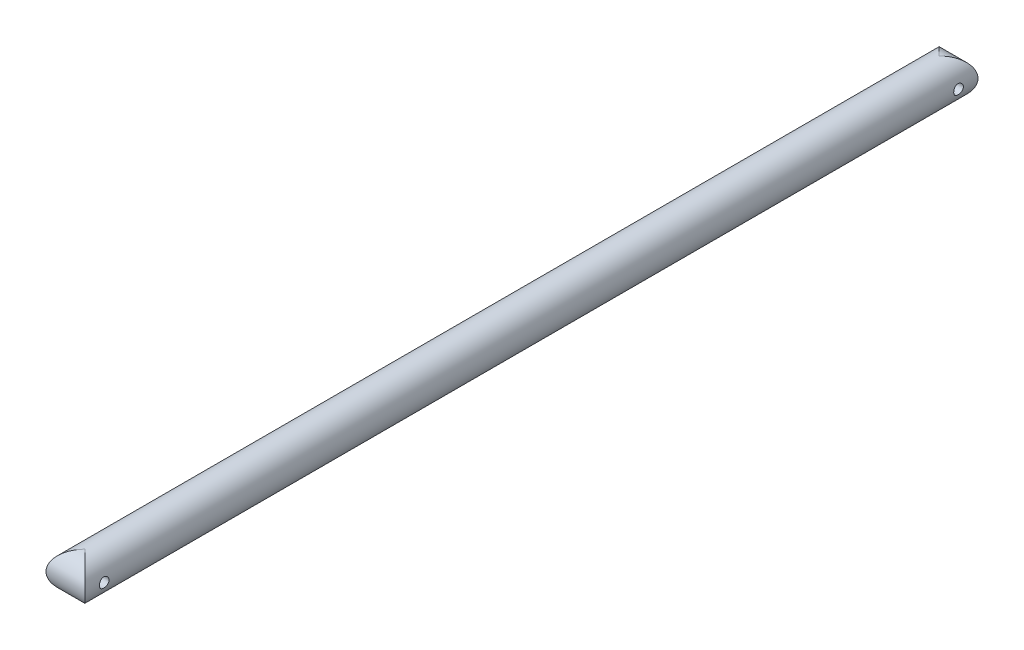
ISO-10303-21;
HEADER;
FILE_DESCRIPTION(('STEP AP214'),'2;1');
FILE_NAME('part.step','',(''),(''),'','','');
FILE_SCHEMA(('AUTOMOTIVE_DESIGN { 1 0 10303 214 1 1 1 1 }'));
ENDSEC;
DATA;
#1=APPLICATION_CONTEXT('core data for automotive mechanical design processes');
#2=APPLICATION_PROTOCOL_DEFINITION('international standard','automotive_design',2000,#1);
#3=PRODUCT_CONTEXT('',#1,'mechanical');
#4=PRODUCT('Part','Part','',(#3));
#5=PRODUCT_RELATED_PRODUCT_CATEGORY('part','',(#4));
#6=PRODUCT_DEFINITION_FORMATION('','',#4);
#7=PRODUCT_DEFINITION_CONTEXT('part definition',#1,'design');
#8=PRODUCT_DEFINITION('design','',#6,#7);
#9=PRODUCT_DEFINITION_SHAPE('','',#8);
#10=(LENGTH_UNIT() NAMED_UNIT(*) SI_UNIT(.MILLI.,.METRE.));
#11=(NAMED_UNIT(*) PLANE_ANGLE_UNIT() SI_UNIT($,.RADIAN.));
#12=(NAMED_UNIT(*) SI_UNIT($,.STERADIAN.) SOLID_ANGLE_UNIT());
#13=UNCERTAINTY_MEASURE_WITH_UNIT(LENGTH_MEASURE(1.E-05),#10,'distance_accuracy_value','');
#14=(GEOMETRIC_REPRESENTATION_CONTEXT(3) GLOBAL_UNCERTAINTY_ASSIGNED_CONTEXT((#13)) GLOBAL_UNIT_ASSIGNED_CONTEXT((#10,
#11,#12)) REPRESENTATION_CONTEXT('',''));
#15=CARTESIAN_POINT('',(0.,0.,0.));
#16=DIRECTION('',(0.,0.,1.));
#17=DIRECTION('',(1.,0.,0.));
#18=AXIS2_PLACEMENT_3D('',#15,#16,#17);
#19=CARTESIAN_POINT('',(0.,0.,292.1));
#20=DIRECTION('',(0.,0.,-1.));
#21=DIRECTION('',(-1.,0.,0.));
#22=AXIS2_PLACEMENT_3D('',#19,#20,#21);
#23=CYLINDRICAL_SURFACE('',#22,12.7);
#24=CARTESIAN_POINT('',(-12.7,0.,276.225));
#25=CARTESIAN_POINT('',(-12.6999970338729,0.175421054350859,276.225004922812));
#26=CARTESIAN_POINT('',(-12.6963292371237,0.350897100741706,276.239587115805));
#27=CARTESIAN_POINT('',(-12.6820530760661,0.696820051980883,276.297443236933));
#28=CARTESIAN_POINT('',(-12.6714407780562,0.867264049209657,276.340733426855));
#29=CARTESIAN_POINT('',(-12.6444507573614,1.19807751278638,276.454529753161));
#30=CARTESIAN_POINT('',(-12.6280799601569,1.35845880926009,276.525003207281));
#31=CARTESIAN_POINT('',(-12.591316443928,1.66512267919762,276.691050608928));
#32=CARTESIAN_POINT('',(-12.5709235892463,1.81140477687146,276.786625403118));
#33=CARTESIAN_POINT('',(-12.5278602543575,2.08873074612018,277.002241671435));
#34=CARTESIAN_POINT('',(-12.5051546346354,2.21944287729582,277.122702833663));
#35=CARTESIAN_POINT('',(-12.4602582924963,2.45903522924694,277.383773833724));
#36=CARTESIAN_POINT('',(-12.4380676284689,2.5679129848757,277.524385943571));
#37=CARTESIAN_POINT('',(-12.3963594189446,2.76230618225774,277.824343229927));
#38=CARTESIAN_POINT('',(-12.3768864828385,2.84745052370812,277.983935671878));
#39=CARTESIAN_POINT('',(-12.343330973648,2.98957345643231,278.315734138014));
#40=CARTESIAN_POINT('',(-12.3292475388652,3.04655655068152,278.487938140553));
#41=CARTESIAN_POINT('',(-12.3084267567389,3.12960773790332,278.83642373786));
#42=CARTESIAN_POINT('',(-12.3015478927701,3.15627230130275,279.012554529947));
#43=CARTESIAN_POINT('',(-12.2954915053947,3.17978742389047,279.366913471049));
#44=CARTESIAN_POINT('',(-12.2963127290578,3.17664283351491,279.545141274132));
#45=CARTESIAN_POINT('',(-12.3054365167726,3.14110481048728,279.894063459728));
#46=CARTESIAN_POINT('',(-12.3135572669877,3.10942215340341,280.064835732102));
#47=CARTESIAN_POINT('',(-12.3360753547043,3.01884119561124,280.398560891095));
#48=CARTESIAN_POINT('',(-12.3504731393489,2.95994095604678,280.561513219745));
#49=CARTESIAN_POINT('',(-12.3840899110031,2.8159910616336,280.876878801067));
#50=CARTESIAN_POINT('',(-12.4033560981111,2.73068344564289,281.029169063621));
#51=CARTESIAN_POINT('',(-12.4445122129068,2.53652078423151,281.317527935652));
#52=CARTESIAN_POINT('',(-12.4664025994163,2.42766161831193,281.453593700076));
#53=CARTESIAN_POINT('',(-12.5111061380944,2.18580424890849,281.709714319886));
#54=CARTESIAN_POINT('',(-12.533927803951,2.05220624645099,281.829202003963));
#55=CARTESIAN_POINT('',(-12.5773596047503,1.76659522538275,282.044184963215));
#56=CARTESIAN_POINT('',(-12.5979696721291,1.61458164448174,282.139679505524));
#57=CARTESIAN_POINT('',(-12.6347586626604,1.29564529770887,282.304173740842));
#58=CARTESIAN_POINT('',(-12.6509221227036,1.12867311562485,282.373081303538));
#59=CARTESIAN_POINT('',(-12.676884242985,0.785020883902351,282.481691630419));
#60=CARTESIAN_POINT('',(-12.6866841206814,0.608342698201766,282.521399981085));
#61=CARTESIAN_POINT('',(-12.6986347345774,0.255142937325462,282.569618513766));
#62=CARTESIAN_POINT('',(-12.7009747992585,0.0787330573082926,282.578901071859));
#63=CARTESIAN_POINT('',(-12.6982813685726,-0.273119584996602,282.568122945649));
#64=CARTESIAN_POINT('',(-12.6932485369526,-0.44856243291447,282.548064902742));
#65=CARTESIAN_POINT('',(-12.6764961338622,-0.790816868910306,282.479811577238));
#66=CARTESIAN_POINT('',(-12.6648767569325,-0.957717835150583,282.432037658974));
#67=CARTESIAN_POINT('',(-12.6362609570897,-1.28112793569122,282.310190005473));
#68=CARTESIAN_POINT('',(-12.6192639911647,-1.43763601861918,282.236113614204));
#69=CARTESIAN_POINT('',(-12.5813250177716,-1.7388906345432,282.062266860549));
#70=CARTESIAN_POINT('',(-12.5603183592593,-1.88337918521908,281.962063895427));
#71=CARTESIAN_POINT('',(-12.5167921111411,-2.15376466554505,281.739361359713));
#72=CARTESIAN_POINT('',(-12.4942722608556,-2.27965837982677,281.616857941143));
#73=CARTESIAN_POINT('',(-12.4495762556411,-2.51246336908681,281.349445849547));
#74=CARTESIAN_POINT('',(-12.4274221051899,-2.61883285313135,281.204061028651));
#75=CARTESIAN_POINT('',(-12.3865825924258,-2.80566443991226,280.897049257042));
#76=CARTESIAN_POINT('',(-12.3678970761538,-2.88612769264183,280.735423027713));
#77=CARTESIAN_POINT('',(-12.3363163381503,-3.01826384028545,280.401382887573));
#78=CARTESIAN_POINT('',(-12.3233869021911,-3.07010730622847,280.229039853404));
#79=CARTESIAN_POINT('',(-12.3047494152553,-3.14398164687974,279.877711266541));
#80=CARTESIAN_POINT('',(-12.299039785006,-3.16601904149257,279.698727175344));
#81=CARTESIAN_POINT('',(-12.2956087422145,-3.17931501621078,279.34471049948));
#82=CARTESIAN_POINT('',(-12.2976625750886,-3.17143955029542,279.169712095613));
#83=CARTESIAN_POINT('',(-12.3090074061494,-3.12711523908734,278.823623435624));
#84=CARTESIAN_POINT('',(-12.3182982588945,-3.09066696801941,278.652533101033));
#85=CARTESIAN_POINT('',(-12.3429450180984,-2.99070462615694,278.320058761656));
#86=CARTESIAN_POINT('',(-12.3582644892528,-2.92735297324097,278.158623037245));
#87=CARTESIAN_POINT('',(-12.3932474960913,-2.77551073379665,277.848556606586));
#88=CARTESIAN_POINT('',(-12.4129116342002,-2.68701666057219,277.699927680087));
#89=CARTESIAN_POINT('',(-12.4550092586011,-2.48468673461554,277.415509368613));
#90=CARTESIAN_POINT('',(-12.4775016056118,-2.37025002816438,277.280156061253));
#91=CARTESIAN_POINT('',(-12.5223699100401,-2.12045416901827,277.030292088516));
#92=CARTESIAN_POINT('',(-12.5447458385544,-1.98509005500279,276.915786379594));
#93=CARTESIAN_POINT('',(-12.5873437112106,-1.69432305852056,276.708846063538));
#94=CARTESIAN_POINT('',(-12.6075193062447,-1.53860166056976,276.616848734395));
#95=CARTESIAN_POINT('',(-12.6429542453062,-1.21341315929724,276.460484536776));
#96=CARTESIAN_POINT('',(-12.6582171100619,-1.04395600927451,276.396097869961));
#97=CARTESIAN_POINT('',(-12.6798505941374,-0.729001702698753,276.306339625802));
#98=CARTESIAN_POINT('',(-12.6873547169486,-0.585004695088814,276.275903202204));
#99=CARTESIAN_POINT('',(-12.6974304774095,-0.294017851418533,276.235232086));
#100=CARTESIAN_POINT('',(-12.7000024860439,-0.147028241296938,276.22499587397));
#101=CARTESIAN_POINT('',(-12.7,0.,276.225));
#102=B_SPLINE_CURVE_WITH_KNOTS('',3,(#24,#25,#26,#27,#28,#29,#30,#31,#32,#33,#34,#35,#36,#37,
#38,#39,#40,#41,#42,#43,#44,#45,#46,#47,#48,#49,#50,#51,#52,#53,#54,#55,#56,#57,#58,#59,#60,#61,
#62,#63,#64,#65,#66,#67,#68,#69,#70,#71,#72,#73,#74,#75,#76,#77,#78,#79,#80,#81,#82,#83,#84,#85,
#86,#87,#88,#89,#90,#91,#92,#93,#94,#95,#96,#97,#98,#99,#100,#101),.UNSPECIFIED.,.T.,.F.,(4,2,2,
2,2,2,2,2,2,2,2,2,2,2,2,2,2,2,2,2,2,2,2,2,2,2,2,2,2,2,2,2,2,2,2,2,2,2,4),(0.,0.525724358065494,
1.05174676993358,1.57713870983892,2.10254837335838,2.63767221675276,3.17285644277794,
3.71599137305288,4.25903942808487,4.79120824630596,5.32329047345565,5.84247618671875,
6.36169889010139,6.88616284006741,7.41071862276898,7.95023177058111,8.48976139571974,
9.03114418076311,9.57242335981315,10.0998508728299,10.6272309069566,11.1467958106173,
11.6664131950586,12.1952509368701,12.7241800170732,13.2660921115649,13.8079801469347,
14.3466027227599,14.8851074589669,15.4081433519173,15.9311687337376,16.4510804786764,
16.9710643590659,17.5046127008446,18.0382877269753,18.5816279265761,19.12457786772,
19.5652441424436,20.0058772697458),.UNSPECIFIED.);
#103=CARTESIAN_POINT('',(-12.7,0.,276.225));
#104=VERTEX_POINT('',#103);
#105=EDGE_CURVE('E12',#104,#104,#102,.T.);
#106=ORIENTED_EDGE('',*,*,#105,.T.);
#107=EDGE_LOOP('',(#106));
#108=FACE_BOUND('',#107,.T.);
#109=CARTESIAN_POINT('',(12.7,0.,276.225));
#110=CARTESIAN_POINT('',(12.6999970338729,-0.17542105435093,276.225004922812));
#111=CARTESIAN_POINT('',(12.6963292371237,-0.350897100741782,276.239587115805));
#112=CARTESIAN_POINT('',(12.6820530760661,-0.696820051980958,276.297443236933));
#113=CARTESIAN_POINT('',(12.6714407780562,-0.867264049209724,276.340733426855));
#114=CARTESIAN_POINT('',(12.6444507573613,-1.19807751278646,276.454529753161));
#115=CARTESIAN_POINT('',(12.6280799601569,-1.3584588092602,276.525003207281));
#116=CARTESIAN_POINT('',(12.591316443928,-1.66512267919774,276.691050608928));
#117=CARTESIAN_POINT('',(12.5709235892463,-1.81140477687157,276.786625403118));
#118=CARTESIAN_POINT('',(12.5278602543575,-2.08873074612028,277.002241671435));
#119=CARTESIAN_POINT('',(12.5051546346353,-2.21944287729591,277.122702833663));
#120=CARTESIAN_POINT('',(12.4602582924963,-2.45903522924704,277.383773833724));
#121=CARTESIAN_POINT('',(12.4380676284689,-2.5679129848758,277.524385943571));
#122=CARTESIAN_POINT('',(12.3963594189446,-2.76230618225783,277.824343229927));
#123=CARTESIAN_POINT('',(12.3768864828385,-2.84745052370821,277.983935671878));
#124=CARTESIAN_POINT('',(12.343330973648,-2.98957345643241,278.315734138014));
#125=CARTESIAN_POINT('',(12.3292475388652,-3.04655655068164,278.487938140553));
#126=CARTESIAN_POINT('',(12.3084267567388,-3.12960773790344,278.83642373786));
#127=CARTESIAN_POINT('',(12.3015478927701,-3.15627230130287,279.012554529947));
#128=CARTESIAN_POINT('',(12.2954915053947,-3.1797874238906,279.366913471049));
#129=CARTESIAN_POINT('',(12.2963127290578,-3.17664283351505,279.545141274132));
#130=CARTESIAN_POINT('',(12.3054365167726,-3.14110481048742,279.894063459728));
#131=CARTESIAN_POINT('',(12.3135572669877,-3.10942215340355,280.064835732102));
#132=CARTESIAN_POINT('',(12.3360753547043,-3.01884119561138,280.398560891095));
#133=CARTESIAN_POINT('',(12.3504731393489,-2.95994095604694,280.561513219744));
#134=CARTESIAN_POINT('',(12.3840899110031,-2.81599106163378,280.876878801067));
#135=CARTESIAN_POINT('',(12.4033560981111,-2.73068344564309,281.029169063621));
#136=CARTESIAN_POINT('',(12.4445122129068,-2.53652078423172,281.317527935652));
#137=CARTESIAN_POINT('',(12.4664025994163,-2.42766161831213,281.453593700076));
#138=CARTESIAN_POINT('',(12.5111061380944,-2.18580424890868,281.709714319886));
#139=CARTESIAN_POINT('',(12.533927803951,-2.05220624645117,281.829202003963));
#140=CARTESIAN_POINT('',(12.5773596047503,-1.76659522538292,282.044184963215));
#141=CARTESIAN_POINT('',(12.5979696721291,-1.6145816444819,282.139679505524));
#142=CARTESIAN_POINT('',(12.6347586626604,-1.29564529770904,282.304173740842));
#143=CARTESIAN_POINT('',(12.6509221227035,-1.12867311562502,282.373081303538));
#144=CARTESIAN_POINT('',(12.676884242985,-0.785020883902544,282.481691630419));
#145=CARTESIAN_POINT('',(12.6866841206814,-0.608342698201967,282.521399981085));
#146=CARTESIAN_POINT('',(12.6986347345774,-0.255142937325667,282.569618513766));
#147=CARTESIAN_POINT('',(12.7009747992585,-0.0787330573084925,282.578901071859));
#148=CARTESIAN_POINT('',(12.6982813685726,0.273119584996407,282.568122945649));
#149=CARTESIAN_POINT('',(12.6932485369526,0.448562432914275,282.548064902742));
#150=CARTESIAN_POINT('',(12.6764961338623,0.790816868910122,282.479811577238));
#151=CARTESIAN_POINT('',(12.6648767569325,0.957717835150409,282.432037658974));
#152=CARTESIAN_POINT('',(12.6362609570897,1.28112793569105,282.310190005473));
#153=CARTESIAN_POINT('',(12.6192639911647,1.43763601861899,282.236113614204));
#154=CARTESIAN_POINT('',(12.5813250177716,1.73889063454301,282.062266860549));
#155=CARTESIAN_POINT('',(12.5603183592593,1.88337918521891,281.962063895427));
#156=CARTESIAN_POINT('',(12.5167921111412,2.15376466554488,281.739361359713));
#157=CARTESIAN_POINT('',(12.4942722608556,2.27965837982659,281.616857941143));
#158=CARTESIAN_POINT('',(12.4495762556412,2.51246336908662,281.349445849547));
#159=CARTESIAN_POINT('',(12.4274221051899,2.61883285313118,281.204061028651));
#160=CARTESIAN_POINT('',(12.3865825924258,2.8056644399121,280.897049257042));
#161=CARTESIAN_POINT('',(12.3678970761539,2.88612769264167,280.735423027713));
#162=CARTESIAN_POINT('',(12.3363163381503,3.01826384028529,280.401382887573));
#163=CARTESIAN_POINT('',(12.3233869021911,3.07010730622831,280.229039853404));
#164=CARTESIAN_POINT('',(12.3047494152553,3.1439816468796,279.877711266541));
#165=CARTESIAN_POINT('',(12.2990397850061,3.16601904149243,279.698727175344));
#166=CARTESIAN_POINT('',(12.2956087422145,3.17931501621064,279.34471049948));
#167=CARTESIAN_POINT('',(12.2976625750886,3.17143955029529,279.169712095613));
#168=CARTESIAN_POINT('',(12.3090074061494,3.12711523908722,278.823623435624));
#169=CARTESIAN_POINT('',(12.3182982588945,3.09066696801929,278.652533101033));
#170=CARTESIAN_POINT('',(12.3429450180984,2.99070462615682,278.320058761656));
#171=CARTESIAN_POINT('',(12.3582644892528,2.92735297324085,278.158623037245));
#172=CARTESIAN_POINT('',(12.3932474960913,2.77551073379652,277.848556606586));
#173=CARTESIAN_POINT('',(12.4129116342002,2.68701666057208,277.699927680087));
#174=CARTESIAN_POINT('',(12.4550092586011,2.48468673461543,277.415509368613));
#175=CARTESIAN_POINT('',(12.4775016056118,2.37025002816426,277.280156061253));
#176=CARTESIAN_POINT('',(12.5223699100401,2.12045416901815,277.030292088516));
#177=CARTESIAN_POINT('',(12.5447458385544,1.98509005500268,276.915786379594));
#178=CARTESIAN_POINT('',(12.5873437112106,1.69432305852046,276.708846063538));
#179=CARTESIAN_POINT('',(12.6075193062447,1.53860166056966,276.616848734395));
#180=CARTESIAN_POINT('',(12.6429542453062,1.21341315929715,276.460484536776));
#181=CARTESIAN_POINT('',(12.6582171100619,1.04395600927441,276.396097869961));
#182=CARTESIAN_POINT('',(12.6798505941374,0.729001702698668,276.306339625802));
#183=CARTESIAN_POINT('',(12.6873547169486,0.585004695088736,276.275903202204));
#184=CARTESIAN_POINT('',(12.6974304774096,0.294017851418464,276.235232086));
#185=CARTESIAN_POINT('',(12.7000024860439,0.147028241296871,276.22499587397));
#186=CARTESIAN_POINT('',(12.7,0.,276.225));
#187=B_SPLINE_CURVE_WITH_KNOTS('',3,(#109,#110,#111,#112,#113,#114,#115,#116,#117,#118,#119,
#120,#121,#122,#123,#124,#125,#126,#127,#128,#129,#130,#131,#132,#133,#134,#135,#136,#137,#138,
#139,#140,#141,#142,#143,#144,#145,#146,#147,#148,#149,#150,#151,#152,#153,#154,#155,#156,#157,
#158,#159,#160,#161,#162,#163,#164,#165,#166,#167,#168,#169,#170,#171,#172,#173,#174,#175,#176,
#177,#178,#179,#180,#181,#182,#183,#184,#185,#186),.UNSPECIFIED.,.T.,.F.,(4,2,2,2,2,2,2,2,2,2,2,
2,2,2,2,2,2,2,2,2,2,2,2,2,2,2,2,2,2,2,2,2,2,2,2,2,2,2,4),(0.,0.525724358065494,1.05174676993359,
1.57713870983894,2.10254837335844,2.63767221675277,3.17285644277796,3.71599137305284,
4.25903942808489,4.79120824630593,5.32329047345567,5.84247618671883,6.36169889010141,
6.88616284006731,7.41071862276898,7.95023177058117,8.4897613957198,9.03114418076315,
9.57242335981316,10.0998508728299,10.6272309069566,11.1467958106173,11.6664131950587,
12.1952509368701,12.7241800170733,13.2660921115649,13.8079801469348,14.3466027227598,
14.8851074589669,15.4081433519174,15.9311687337376,16.4510804786765,16.9710643590659,
17.5046127008446,18.0382877269753,18.5816279265761,19.12457786772,19.5652441424436,
20.0058772697458),.UNSPECIFIED.);
#188=CARTESIAN_POINT('',(12.7,0.,276.225));
#189=VERTEX_POINT('',#188);
#190=EDGE_CURVE('E217',#189,#189,#187,.T.);
#191=ORIENTED_EDGE('',*,*,#190,.T.);
#192=EDGE_LOOP('',(#191));
#193=FACE_BOUND('',#192,.T.);
#194=CARTESIAN_POINT('',(0.,0.,-279.4));
#195=DIRECTION('',(0.707106781186547,0.,-0.707106781186547));
#196=DIRECTION('',(-0.707106781186547,0.,-0.707106781186547));
#197=AXIS2_PLACEMENT_3D('',#194,#195,#196);
#198=ELLIPSE('',#197,17.9605122421383,12.7);
#199=CARTESIAN_POINT('',(0.,12.7000000000001,-279.4));
#200=VERTEX_POINT('',#199);
#201=CARTESIAN_POINT('',(0.,-12.7,-279.4));
#202=VERTEX_POINT('',#201);
#203=EDGE_CURVE('E230',#200,#202,#198,.F.);
#204=ORIENTED_EDGE('',*,*,#203,.T.);
#205=CARTESIAN_POINT('',(0.,0.,-279.4));
#206=DIRECTION('',(-0.707106781186547,0.,-0.707106781186547));
#207=DIRECTION('',(0.707106781186547,0.,-0.707106781186547));
#208=AXIS2_PLACEMENT_3D('',#205,#206,#207);
#209=ELLIPSE('',#208,17.9605122421383,12.7);
#210=EDGE_CURVE('E320',#202,#200,#209,.F.);
#211=ORIENTED_EDGE('',*,*,#210,.T.);
#212=EDGE_LOOP('',(#204,#211));
#213=FACE_BOUND('',#212,.T.);
#214=CARTESIAN_POINT('',(12.7,0.,-282.575));
#215=CARTESIAN_POINT('',(12.6999970338729,0.175421054350927,-282.574995077188));
#216=CARTESIAN_POINT('',(12.6963292371237,0.350897100741774,-282.560412884195));
#217=CARTESIAN_POINT('',(12.6820530760661,0.696820051980951,-282.502556763067));
#218=CARTESIAN_POINT('',(12.6714407780562,0.867264049209724,-282.459266573145));
#219=CARTESIAN_POINT('',(12.6444507573613,1.19807751278645,-282.345470246839));
#220=CARTESIAN_POINT('',(12.6280799601569,1.35845880926016,-282.274996792719));
#221=CARTESIAN_POINT('',(12.591316443928,1.66512267919769,-282.108949391072));
#222=CARTESIAN_POINT('',(12.5709235892463,1.81140477687153,-282.013374596881));
#223=CARTESIAN_POINT('',(12.5278602543575,2.08873074612025,-281.797758328565));
#224=CARTESIAN_POINT('',(12.5051546346353,2.21944287729588,-281.677297166337));
#225=CARTESIAN_POINT('',(12.4602582924963,2.45903522924701,-281.416226166276));
#226=CARTESIAN_POINT('',(12.4380676284689,2.56791298487577,-281.275614056429));
#227=CARTESIAN_POINT('',(12.3963594189446,2.76230618225781,-280.975656770073));
#228=CARTESIAN_POINT('',(12.3768864828385,2.84745052370819,-280.816064328122));
#229=CARTESIAN_POINT('',(12.343330973648,2.98957345643237,-280.484265861986));
#230=CARTESIAN_POINT('',(12.3292475388652,3.04655655068159,-280.312061859447));
#231=CARTESIAN_POINT('',(12.3084267567388,3.12960773790339,-279.96357626214));
#232=CARTESIAN_POINT('',(12.3015478927701,3.15627230130282,-279.787445470053));
#233=CARTESIAN_POINT('',(12.2954915053947,3.17978742389054,-279.433086528951));
#234=CARTESIAN_POINT('',(12.2963127290578,3.17664283351498,-279.254858725868));
#235=CARTESIAN_POINT('',(12.3054365167726,3.14110481048735,-278.905936540272));
#236=CARTESIAN_POINT('',(12.3135572669877,3.10942215340348,-278.735164267898));
#237=CARTESIAN_POINT('',(12.3360753547043,3.01884119561131,-278.401439108905));
#238=CARTESIAN_POINT('',(12.3504731393489,2.95994095604685,-278.238486780255));
#239=CARTESIAN_POINT('',(12.3840899110031,2.81599106163367,-277.923121198933));
#240=CARTESIAN_POINT('',(12.4033560981111,2.73068344564298,-277.770830936379));
#241=CARTESIAN_POINT('',(12.4445122129068,2.5365207842316,-277.482472064348));
#242=CARTESIAN_POINT('',(12.4664025994163,2.42766161831201,-277.346406299924));
#243=CARTESIAN_POINT('',(12.5111061380944,2.18580424890857,-277.090285680114));
#244=CARTESIAN_POINT('',(12.533927803951,2.05220624645108,-276.970797996037));
#245=CARTESIAN_POINT('',(12.5773596047503,1.76659522538284,-276.755815036785));
#246=CARTESIAN_POINT('',(12.5979696721291,1.61458164448181,-276.660320494475));
#247=CARTESIAN_POINT('',(12.6347586626604,1.29564529770894,-276.495826259158));
#248=CARTESIAN_POINT('',(12.6509221227036,1.12867311562491,-276.426918696461));
#249=CARTESIAN_POINT('',(12.676884242985,0.785020883902422,-276.318308369581));
#250=CARTESIAN_POINT('',(12.6866841206814,0.608342698201836,-276.278600018915));
#251=CARTESIAN_POINT('',(12.6986347345774,0.255142937325533,-276.230381486234));
#252=CARTESIAN_POINT('',(12.7009747992585,0.0787330573083616,-276.221098928141));
#253=CARTESIAN_POINT('',(12.6982813685726,-0.27311958499653,-276.231877054351));
#254=CARTESIAN_POINT('',(12.6932485369526,-0.448562432914395,-276.251935097258));
#255=CARTESIAN_POINT('',(12.6764961338622,-0.790816868910236,-276.320188422762));
#256=CARTESIAN_POINT('',(12.6648767569325,-0.95771783515052,-276.367962341026));
#257=CARTESIAN_POINT('',(12.6362609570897,-1.28112793569115,-276.489809994527));
#258=CARTESIAN_POINT('',(12.6192639911647,-1.4376360186191,-276.563886385796));
#259=CARTESIAN_POINT('',(12.5813250177716,-1.73889063454314,-276.737733139451));
#260=CARTESIAN_POINT('',(12.5603183592593,-1.88337918521905,-276.837936104573));
#261=CARTESIAN_POINT('',(12.5167921111412,-2.15376466554502,-277.060638640287));
#262=CARTESIAN_POINT('',(12.4942722608556,-2.27965837982671,-277.183142058857));
#263=CARTESIAN_POINT('',(12.4495762556412,-2.51246336908673,-277.450554150453));
#264=CARTESIAN_POINT('',(12.4274221051899,-2.61883285313128,-277.595938971349));
#265=CARTESIAN_POINT('',(12.3865825924258,-2.80566443991219,-277.902950742958));
#266=CARTESIAN_POINT('',(12.3678970761538,-2.88612769264176,-278.064576972287));
#267=CARTESIAN_POINT('',(12.3363163381503,-3.01826384028538,-278.398617112427));
#268=CARTESIAN_POINT('',(12.3233869021911,-3.0701073062284,-278.570960146596));
#269=CARTESIAN_POINT('',(12.3047494152553,-3.14398164687968,-278.922288733459));
#270=CARTESIAN_POINT('',(12.299039785006,-3.1660190414925,-279.101272824656));
#271=CARTESIAN_POINT('',(12.2956087422145,-3.17931501621071,-279.45528950052));
#272=CARTESIAN_POINT('',(12.2976625750886,-3.17143955029535,-279.630287904387));
#273=CARTESIAN_POINT('',(12.3090074061494,-3.12711523908727,-279.976376564376));
#274=CARTESIAN_POINT('',(12.3182982588945,-3.09066696801934,-280.147466898967));
#275=CARTESIAN_POINT('',(12.3429450180984,-2.99070462615687,-280.479941238344));
#276=CARTESIAN_POINT('',(12.3582644892528,-2.92735297324089,-280.641376962755));
#277=CARTESIAN_POINT('',(12.3932474960913,-2.77551073379656,-280.951443393414));
#278=CARTESIAN_POINT('',(12.4129116342002,-2.68701666057211,-281.100072319913));
#279=CARTESIAN_POINT('',(12.4550092586011,-2.48468673461547,-281.384490631387));
#280=CARTESIAN_POINT('',(12.4775016056118,-2.37025002816431,-281.519843938747));
#281=CARTESIAN_POINT('',(12.5223699100401,-2.1204541690182,-281.769707911484));
#282=CARTESIAN_POINT('',(12.5447458385544,-1.98509005500273,-281.884213620406));
#283=CARTESIAN_POINT('',(12.5873437112106,-1.69432305852049,-282.091153936462));
#284=CARTESIAN_POINT('',(12.6075193062447,-1.53860166056969,-282.183151265605));
#285=CARTESIAN_POINT('',(12.6429542453062,-1.21341315929718,-282.339515463224));
#286=CARTESIAN_POINT('',(12.6582171100619,-1.04395600927444,-282.403902130039));
#287=CARTESIAN_POINT('',(12.6798505941374,-0.729001702698682,-282.493660374198));
#288=CARTESIAN_POINT('',(12.6873547169486,-0.585004695088742,-282.524096797796));
#289=CARTESIAN_POINT('',(12.6974304774095,-0.294017851418462,-282.564767914));
#290=CARTESIAN_POINT('',(12.7000024860439,-0.147028241296869,-282.57500412603));
#291=CARTESIAN_POINT('',(12.7,0.,-282.575));
#292=B_SPLINE_CURVE_WITH_KNOTS('',3,(#214,#215,#216,#217,#218,#219,#220,#221,#222,#223,#224,
#225,#226,#227,#228,#229,#230,#231,#232,#233,#234,#235,#236,#237,#238,#239,#240,#241,#242,#243,
#244,#245,#246,#247,#248,#249,#250,#251,#252,#253,#254,#255,#256,#257,#258,#259,#260,#261,#262,
#263,#264,#265,#266,#267,#268,#269,#270,#271,#272,#273,#274,#275,#276,#277,#278,#279,#280,#281,
#282,#283,#284,#285,#286,#287,#288,#289,#290,#291),.UNSPECIFIED.,.T.,.F.,(4,2,2,2,2,2,2,2,2,2,2,
2,2,2,2,2,2,2,2,2,2,2,2,2,2,2,2,2,2,2,2,2,2,2,2,2,2,2,4),(0.,0.525724358065494,1.05174676993358,
1.57713870983892,2.10254837335838,2.63767221675276,3.17285644277795,3.71599137305288,
4.25903942808487,4.79120824630596,5.32329047345565,5.84247618671875,6.36169889010139,
6.88616284006736,7.41071862276898,7.95023177058109,8.48976139571974,9.03114418076312,
9.57242335981315,10.0998508728299,10.6272309069566,11.1467958106173,11.6664131950587,
12.1952509368702,12.7241800170733,13.2660921115649,13.8079801469347,14.3466027227599,
14.8851074589669,15.4081433519174,15.9311687337376,16.4510804786765,16.9710643590659,
17.5046127008446,18.0382877269753,18.5816279265761,19.12457786772,19.5652441424436,
20.0058772697458),.UNSPECIFIED.);
#293=CARTESIAN_POINT('',(12.7,0.,-282.575));
#294=VERTEX_POINT('',#293);
#295=EDGE_CURVE('E239',#294,#294,#292,.T.);
#296=ORIENTED_EDGE('',*,*,#295,.F.);
#297=EDGE_LOOP('',(#296));
#298=FACE_BOUND('',#297,.T.);
#299=CARTESIAN_POINT('',(-12.7,0.,-282.575));
#300=CARTESIAN_POINT('',(-12.6999970338729,-0.175421054350926,-282.574995077188));
#301=CARTESIAN_POINT('',(-12.6963292371237,-0.350897100741773,-282.560412884195));
#302=CARTESIAN_POINT('',(-12.6820530760661,-0.69682005198095,-282.502556763067));
#303=CARTESIAN_POINT('',(-12.6714407780562,-0.867264049209724,-282.459266573145));
#304=CARTESIAN_POINT('',(-12.6444507573613,-1.19807751278645,-282.345470246839));
#305=CARTESIAN_POINT('',(-12.6280799601569,-1.35845880926016,-282.274996792719));
#306=CARTESIAN_POINT('',(-12.591316443928,-1.66512267919769,-282.108949391072));
#307=CARTESIAN_POINT('',(-12.5709235892463,-1.81140477687153,-282.013374596881));
#308=CARTESIAN_POINT('',(-12.5278602543575,-2.08873074612025,-281.797758328565));
#309=CARTESIAN_POINT('',(-12.5051546346353,-2.21944287729588,-281.677297166337));
#310=CARTESIAN_POINT('',(-12.4602582924963,-2.45903522924701,-281.416226166276));
#311=CARTESIAN_POINT('',(-12.4380676284689,-2.56791298487577,-281.275614056429));
#312=CARTESIAN_POINT('',(-12.3963594189446,-2.76230618225781,-280.975656770073));
#313=CARTESIAN_POINT('',(-12.3768864828385,-2.84745052370819,-280.816064328122));
#314=CARTESIAN_POINT('',(-12.343330973648,-2.98957345643237,-280.484265861986));
#315=CARTESIAN_POINT('',(-12.3292475388652,-3.04655655068159,-280.312061859447));
#316=CARTESIAN_POINT('',(-12.3084267567388,-3.12960773790338,-279.96357626214));
#317=CARTESIAN_POINT('',(-12.3015478927701,-3.15627230130281,-279.787445470053));
#318=CARTESIAN_POINT('',(-12.2954915053947,-3.17978742389053,-279.433086528951));
#319=CARTESIAN_POINT('',(-12.2963127290578,-3.17664283351498,-279.254858725868));
#320=CARTESIAN_POINT('',(-12.3054365167726,-3.14110481048735,-278.905936540272));
#321=CARTESIAN_POINT('',(-12.3135572669877,-3.10942215340348,-278.735164267898));
#322=CARTESIAN_POINT('',(-12.3360753547043,-3.0188411956113,-278.401439108905));
#323=CARTESIAN_POINT('',(-12.3504731393489,-2.95994095604685,-278.238486780255));
#324=CARTESIAN_POINT('',(-12.3840899110031,-2.81599106163367,-277.923121198933));
#325=CARTESIAN_POINT('',(-12.4033560981111,-2.73068344564297,-277.770830936379));
#326=CARTESIAN_POINT('',(-12.4445122129068,-2.5365207842316,-277.482472064348));
#327=CARTESIAN_POINT('',(-12.4664025994163,-2.427661618312,-277.346406299924));
#328=CARTESIAN_POINT('',(-12.5111061380944,-2.18580424890857,-277.090285680114));
#329=CARTESIAN_POINT('',(-12.533927803951,-2.05220624645108,-276.970797996037));
#330=CARTESIAN_POINT('',(-12.5773596047503,-1.76659522538284,-276.755815036785));
#331=CARTESIAN_POINT('',(-12.5979696721291,-1.61458164448181,-276.660320494475));
#332=CARTESIAN_POINT('',(-12.6347586626604,-1.29564529770894,-276.495826259158));
#333=CARTESIAN_POINT('',(-12.6509221227036,-1.12867311562491,-276.426918696461));
#334=CARTESIAN_POINT('',(-12.676884242985,-0.785020883902419,-276.318308369581));
#335=CARTESIAN_POINT('',(-12.6866841206814,-0.608342698201834,-276.278600018915));
#336=CARTESIAN_POINT('',(-12.6986347345774,-0.25514293732553,-276.230381486234));
#337=CARTESIAN_POINT('',(-12.7009747992585,-0.0787330573083597,-276.221098928141));
#338=CARTESIAN_POINT('',(-12.6982813685726,0.273119584996534,-276.231877054351));
#339=CARTESIAN_POINT('',(-12.6932485369526,0.448562432914402,-276.251935097258));
#340=CARTESIAN_POINT('',(-12.6764961338622,0.790816868910239,-276.320188422762));
#341=CARTESIAN_POINT('',(-12.6648767569325,0.957717835150517,-276.367962341026));
#342=CARTESIAN_POINT('',(-12.6362609570897,1.28112793569115,-276.489809994527));
#343=CARTESIAN_POINT('',(-12.6192639911647,1.43763601861911,-276.563886385796));
#344=CARTESIAN_POINT('',(-12.5813250177716,1.73889063454315,-276.737733139451));
#345=CARTESIAN_POINT('',(-12.5603183592593,1.88337918521905,-276.837936104573));
#346=CARTESIAN_POINT('',(-12.5167921111412,2.15376466554502,-277.060638640287));
#347=CARTESIAN_POINT('',(-12.4942722608556,2.27965837982671,-277.183142058857));
#348=CARTESIAN_POINT('',(-12.4495762556412,2.51246336908673,-277.450554150453));
#349=CARTESIAN_POINT('',(-12.4274221051899,2.61883285313128,-277.595938971349));
#350=CARTESIAN_POINT('',(-12.3865825924258,2.8056644399122,-277.902950742958));
#351=CARTESIAN_POINT('',(-12.3678970761538,2.88612769264176,-278.064576972287));
#352=CARTESIAN_POINT('',(-12.3363163381503,3.01826384028539,-278.398617112427));
#353=CARTESIAN_POINT('',(-12.3233869021911,3.07010730622841,-278.570960146596));
#354=CARTESIAN_POINT('',(-12.3047494152553,3.14398164687968,-278.922288733459));
#355=CARTESIAN_POINT('',(-12.299039785006,3.1660190414925,-279.101272824656));
#356=CARTESIAN_POINT('',(-12.2956087422145,3.17931501621071,-279.45528950052));
#357=CARTESIAN_POINT('',(-12.2976625750886,3.17143955029535,-279.630287904387));
#358=CARTESIAN_POINT('',(-12.3090074061494,3.12711523908727,-279.976376564376));
#359=CARTESIAN_POINT('',(-12.3182982588945,3.09066696801935,-280.147466898967));
#360=CARTESIAN_POINT('',(-12.3429450180984,2.99070462615687,-280.479941238344));
#361=CARTESIAN_POINT('',(-12.3582644892528,2.9273529732409,-280.641376962755));
#362=CARTESIAN_POINT('',(-12.3932474960913,2.77551073379656,-280.951443393414));
#363=CARTESIAN_POINT('',(-12.4129116342002,2.68701666057211,-281.100072319913));
#364=CARTESIAN_POINT('',(-12.4550092586011,2.48468673461547,-281.384490631387));
#365=CARTESIAN_POINT('',(-12.4775016056118,2.37025002816431,-281.519843938747));
#366=CARTESIAN_POINT('',(-12.5223699100401,2.1204541690182,-281.769707911484));
#367=CARTESIAN_POINT('',(-12.5447458385544,1.98509005500273,-281.884213620406));
#368=CARTESIAN_POINT('',(-12.5873437112106,1.69432305852049,-282.091153936462));
#369=CARTESIAN_POINT('',(-12.6075193062447,1.53860166056969,-282.183151265605));
#370=CARTESIAN_POINT('',(-12.6429542453062,1.21341315929718,-282.339515463224));
#371=CARTESIAN_POINT('',(-12.6582171100619,1.04395600927444,-282.403902130039));
#372=CARTESIAN_POINT('',(-12.6798505941374,0.729001702698684,-282.493660374198));
#373=CARTESIAN_POINT('',(-12.6873547169486,0.585004695088744,-282.524096797796));
#374=CARTESIAN_POINT('',(-12.6974304774095,0.294017851418463,-282.564767914));
#375=CARTESIAN_POINT('',(-12.7000024860439,0.14702824129687,-282.57500412603));
#376=CARTESIAN_POINT('',(-12.7,0.,-282.575));
#377=B_SPLINE_CURVE_WITH_KNOTS('',3,(#299,#300,#301,#302,#303,#304,#305,#306,#307,#308,#309,
#310,#311,#312,#313,#314,#315,#316,#317,#318,#319,#320,#321,#322,#323,#324,#325,#326,#327,#328,
#329,#330,#331,#332,#333,#334,#335,#336,#337,#338,#339,#340,#341,#342,#343,#344,#345,#346,#347,
#348,#349,#350,#351,#352,#353,#354,#355,#356,#357,#358,#359,#360,#361,#362,#363,#364,#365,#366,
#367,#368,#369,#370,#371,#372,#373,#374,#375,#376),.UNSPECIFIED.,.T.,.F.,(4,2,2,2,2,2,2,2,2,2,2,
2,2,2,2,2,2,2,2,2,2,2,2,2,2,2,2,2,2,2,2,2,2,2,2,2,2,2,4),(0.,0.525724358065494,1.05174676993358,
1.57713870983892,2.10254837335838,2.63767221675276,3.17285644277794,3.71599137305288,
4.25903942808487,4.79120824630591,5.32329047345565,5.84247618671875,6.36169889010139,
6.88616284006736,7.41071862276898,7.95023177058109,8.48976139571974,9.03114418076311,
9.57242335981315,10.0998508728299,10.6272309069566,11.1467958106173,11.6664131950586,
12.1952509368702,12.7241800170732,13.2660921115649,13.8079801469347,14.3466027227599,
14.8851074589669,15.4081433519174,15.9311687337376,16.4510804786765,16.9710643590659,
17.5046127008446,18.0382877269753,18.5816279265761,19.12457786772,19.5652441424436,
20.0058772697458),.UNSPECIFIED.);
#378=CARTESIAN_POINT('',(-12.7,0.,-282.575));
#379=VERTEX_POINT('',#378);
#380=EDGE_CURVE('E242',#379,#379,#377,.T.);
#381=ORIENTED_EDGE('',*,*,#380,.F.);
#382=EDGE_LOOP('',(#381));
#383=FACE_BOUND('',#382,.T.);
#384=CARTESIAN_POINT('',(0.,0.,279.4));
#385=DIRECTION('',(0.707106781186547,0.,-0.707106781186547));
#386=DIRECTION('',(-0.707106781186547,0.,-0.707106781186547));
#387=AXIS2_PLACEMENT_3D('',#384,#385,#386);
#388=ELLIPSE('',#387,17.9605122421383,12.7);
#389=CARTESIAN_POINT('',(0.,-12.7000000000001,279.4));
#390=VERTEX_POINT('',#389);
#391=CARTESIAN_POINT('',(0.,12.7,279.4));
#392=VERTEX_POINT('',#391);
#393=EDGE_CURVE('E223',#390,#392,#388,.F.);
#394=ORIENTED_EDGE('',*,*,#393,.F.);
#395=CARTESIAN_POINT('',(0.,0.,279.4));
#396=DIRECTION('',(-0.707106781186547,0.,-0.707106781186547));
#397=DIRECTION('',(0.707106781186547,0.,-0.707106781186547));
#398=AXIS2_PLACEMENT_3D('',#395,#396,#397);
#399=ELLIPSE('',#398,17.9605122421383,12.7);
#400=EDGE_CURVE('E235',#392,#390,#399,.F.);
#401=ORIENTED_EDGE('',*,*,#400,.F.);
#402=EDGE_LOOP('',(#394,#401));
#403=FACE_BOUND('',#402,.T.);
#404=ADVANCED_FACE('F205',(#108,#193,#213,#298,#383,#403),#23,.T.);
#405=CARTESIAN_POINT('',(-12.7,0.,-279.4));
#406=DIRECTION('',(1.,0.,0.));
#407=DIRECTION('',(0.,0.,-1.));
#408=AXIS2_PLACEMENT_3D('',#405,#406,#407);
#409=CYLINDRICAL_SURFACE('',#408,12.7);
#410=ORIENTED_EDGE('',*,*,#210,.F.);
#411=ORIENTED_EDGE('',*,*,#203,.F.);
#412=EDGE_LOOP('',(#410,#411));
#413=FACE_BOUND('',#412,.T.);
#414=ADVANCED_FACE('F259',(#413),#409,.T.);
#415=CARTESIAN_POINT('',(-12.7,0.,279.4));
#416=DIRECTION('',(1.,0.,0.));
#417=DIRECTION('',(0.,0.,-1.));
#418=AXIS2_PLACEMENT_3D('',#415,#416,#417);
#419=CYLINDRICAL_SURFACE('',#418,12.7);
#420=ORIENTED_EDGE('',*,*,#393,.T.);
#421=ORIENTED_EDGE('',*,*,#400,.T.);
#422=EDGE_LOOP('',(#420,#421));
#423=FACE_BOUND('',#422,.T.);
#424=ADVANCED_FACE('F236',(#423),#419,.T.);
#425=CARTESIAN_POINT('',(-12.7,0.,-279.4));
#426=DIRECTION('',(1.,0.,0.));
#427=DIRECTION('',(0.,0.,-1.));
#428=AXIS2_PLACEMENT_3D('',#425,#426,#427);
#429=CYLINDRICAL_SURFACE('',#428,3.17499999999997);
#430=ORIENTED_EDGE('',*,*,#295,.T.);
#431=EDGE_LOOP('',(#430));
#432=FACE_BOUND('',#431,.T.);
#433=ORIENTED_EDGE('',*,*,#380,.T.);
#434=EDGE_LOOP('',(#433));
#435=FACE_BOUND('',#434,.T.);
#436=ADVANCED_FACE('F253',(#432,#435),#429,.F.);
#437=CARTESIAN_POINT('',(-12.7,0.,279.4));
#438=DIRECTION('',(1.,0.,0.));
#439=DIRECTION('',(0.,0.,-1.));
#440=AXIS2_PLACEMENT_3D('',#437,#438,#439);
#441=CYLINDRICAL_SURFACE('',#440,3.17499999999997);
#442=ORIENTED_EDGE('',*,*,#190,.F.);
#443=EDGE_LOOP('',(#442));
#444=FACE_BOUND('',#443,.T.);
#445=ORIENTED_EDGE('',*,*,#105,.F.);
#446=EDGE_LOOP('',(#445));
#447=FACE_BOUND('',#446,.T.);
#448=ADVANCED_FACE('F257',(#444,#447),#441,.F.);
#449=CLOSED_SHELL('',(#404,#414,#424,#436,#448));
#450=MANIFOLD_SOLID_BREP('B2',#449);
#451=ADVANCED_BREP_SHAPE_REPRESENTATION('',(#18,#450),#14);
#452=SHAPE_DEFINITION_REPRESENTATION(#9,#451);
ENDSEC;
END-ISO-10303-21;
